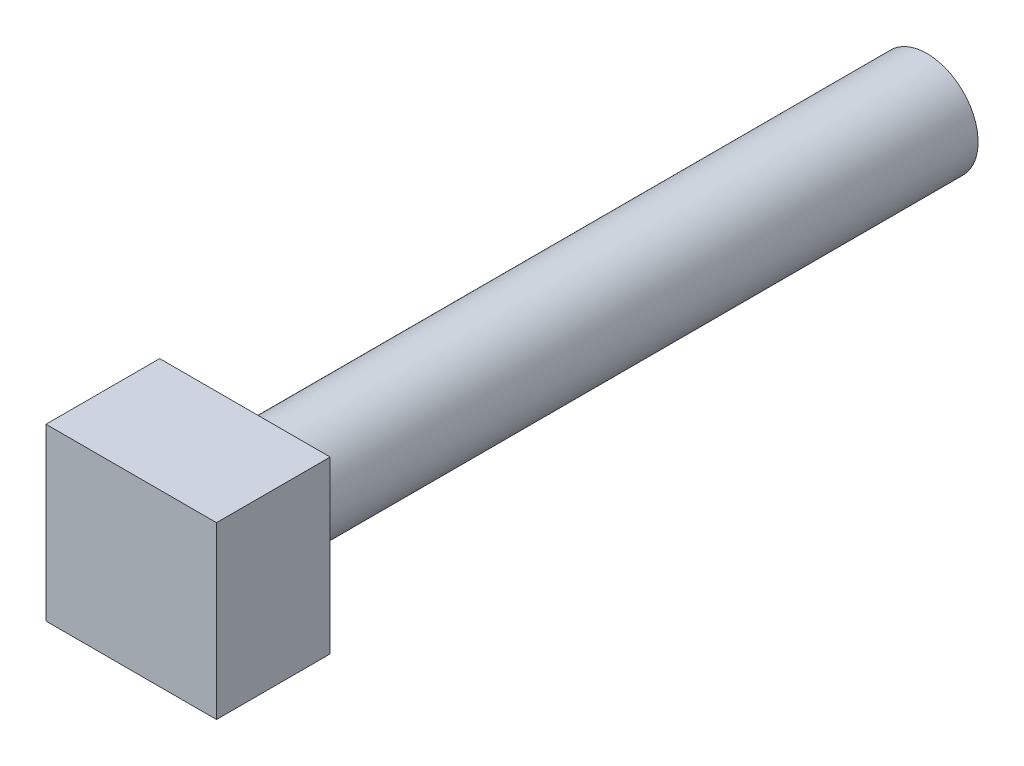
ISO-10303-21;
HEADER;
FILE_DESCRIPTION(('STEP AP214'),'2;1');
FILE_NAME('part.step','',(''),(''),'','','');
FILE_SCHEMA(('AUTOMOTIVE_DESIGN { 1 0 10303 214 1 1 1 1 }'));
ENDSEC;
DATA;
#1=APPLICATION_CONTEXT('core data for automotive mechanical design processes');
#2=APPLICATION_PROTOCOL_DEFINITION('international standard','automotive_design',2000,#1);
#3=PRODUCT_CONTEXT('',#1,'mechanical');
#4=PRODUCT('Part','Part','',(#3));
#5=PRODUCT_RELATED_PRODUCT_CATEGORY('part','',(#4));
#6=PRODUCT_DEFINITION_FORMATION('','',#4);
#7=PRODUCT_DEFINITION_CONTEXT('part definition',#1,'design');
#8=PRODUCT_DEFINITION('design','',#6,#7);
#9=PRODUCT_DEFINITION_SHAPE('','',#8);
#10=(LENGTH_UNIT() NAMED_UNIT(*) SI_UNIT(.MILLI.,.METRE.));
#11=(NAMED_UNIT(*) PLANE_ANGLE_UNIT() SI_UNIT($,.RADIAN.));
#12=(NAMED_UNIT(*) SI_UNIT($,.STERADIAN.) SOLID_ANGLE_UNIT());
#13=UNCERTAINTY_MEASURE_WITH_UNIT(LENGTH_MEASURE(1.E-05),#10,'distance_accuracy_value','');
#14=(GEOMETRIC_REPRESENTATION_CONTEXT(3) GLOBAL_UNCERTAINTY_ASSIGNED_CONTEXT((#13)) GLOBAL_UNIT_ASSIGNED_CONTEXT((#10,
#11,#12)) REPRESENTATION_CONTEXT('',''));
#15=CARTESIAN_POINT('',(0.,0.,0.));
#16=DIRECTION('',(0.,0.,1.));
#17=DIRECTION('',(1.,0.,0.));
#18=AXIS2_PLACEMENT_3D('',#15,#16,#17);
#19=CARTESIAN_POINT('',(4.7625,-4.7625,6.35));
#20=DIRECTION('',(-1.,0.,0.));
#21=DIRECTION('',(0.,0.,1.));
#22=AXIS2_PLACEMENT_3D('',#19,#20,#21);
#23=PLANE('',#22);
#24=DIRECTION('',(0.,1.,0.));
#25=VECTOR('',#24,1.);
#26=CARTESIAN_POINT('',(4.7625,-4.7625,0.));
#27=LINE('',#26,#25);
#28=CARTESIAN_POINT('',(4.7625,-4.7625,0.));
#29=VERTEX_POINT('',#28);
#30=CARTESIAN_POINT('',(4.7625,4.7625,0.));
#31=VERTEX_POINT('',#30);
#32=EDGE_CURVE('E110',#29,#31,#27,.T.);
#33=ORIENTED_EDGE('',*,*,#32,.T.);
#34=DIRECTION('',(0.,0.,-1.));
#35=VECTOR('',#34,1.);
#36=CARTESIAN_POINT('',(4.7625,4.7625,6.35));
#37=LINE('',#36,#35);
#38=CARTESIAN_POINT('',(4.7625,4.7625,6.35));
#39=VERTEX_POINT('',#38);
#40=EDGE_CURVE('E42',#39,#31,#37,.T.);
#41=ORIENTED_EDGE('',*,*,#40,.F.);
#42=DIRECTION('',(0.,1.,0.));
#43=VECTOR('',#42,1.);
#44=CARTESIAN_POINT('',(4.7625,-4.7625,6.35));
#45=LINE('',#44,#43);
#46=CARTESIAN_POINT('',(4.7625,-4.7625,6.35));
#47=VERTEX_POINT('',#46);
#48=EDGE_CURVE('E93',#47,#39,#45,.T.);
#49=ORIENTED_EDGE('',*,*,#48,.F.);
#50=DIRECTION('',(0.,0.,-1.));
#51=VECTOR('',#50,1.);
#52=CARTESIAN_POINT('',(4.7625,-4.7625,6.35));
#53=LINE('',#52,#51);
#54=EDGE_CURVE('E106',#47,#29,#53,.T.);
#55=ORIENTED_EDGE('',*,*,#54,.T.);
#56=EDGE_LOOP('',(#33,#41,#49,#55));
#57=FACE_BOUND('',#56,.T.);
#58=ADVANCED_FACE('F39',(#57),#23,.F.);
#59=CARTESIAN_POINT('',(-4.7625,4.7625,6.35));
#60=DIRECTION('',(0.,-1.,0.));
#61=DIRECTION('',(0.,0.,-1.));
#62=AXIS2_PLACEMENT_3D('',#59,#60,#61);
#63=PLANE('',#62);
#64=DIRECTION('',(-1.,0.,0.));
#65=VECTOR('',#64,1.);
#66=CARTESIAN_POINT('',(-4.7625,4.7625,0.));
#67=LINE('',#66,#65);
#68=CARTESIAN_POINT('',(-4.7625,4.7625,0.));
#69=VERTEX_POINT('',#68);
#70=EDGE_CURVE('E99',#31,#69,#67,.T.);
#71=ORIENTED_EDGE('',*,*,#70,.T.);
#72=DIRECTION('',(0.,0.,-1.));
#73=VECTOR('',#72,1.);
#74=CARTESIAN_POINT('',(-4.7625,4.7625,6.35));
#75=LINE('',#74,#73);
#76=CARTESIAN_POINT('',(-4.7625,4.7625,6.35));
#77=VERTEX_POINT('',#76);
#78=EDGE_CURVE('E97',#77,#69,#75,.T.);
#79=ORIENTED_EDGE('',*,*,#78,.F.);
#80=DIRECTION('',(-1.,0.,0.));
#81=VECTOR('',#80,1.);
#82=CARTESIAN_POINT('',(-4.7625,4.7625,6.35));
#83=LINE('',#82,#81);
#84=EDGE_CURVE('E88',#39,#77,#83,.T.);
#85=ORIENTED_EDGE('',*,*,#84,.F.);
#86=ORIENTED_EDGE('',*,*,#40,.T.);
#87=EDGE_LOOP('',(#71,#79,#85,#86));
#88=FACE_BOUND('',#87,.T.);
#89=ADVANCED_FACE('F98',(#88),#63,.F.);
#90=CARTESIAN_POINT('',(-4.7625,-4.7625,6.35));
#91=DIRECTION('',(1.,0.,0.));
#92=DIRECTION('',(0.,0.,-1.));
#93=AXIS2_PLACEMENT_3D('',#90,#91,#92);
#94=PLANE('',#93);
#95=DIRECTION('',(0.,-1.,0.));
#96=VECTOR('',#95,1.);
#97=CARTESIAN_POINT('',(-4.7625,-4.7625,0.));
#98=LINE('',#97,#96);
#99=CARTESIAN_POINT('',(-4.7625,-4.7625,0.));
#100=VERTEX_POINT('',#99);
#101=EDGE_CURVE('E74',#69,#100,#98,.T.);
#102=ORIENTED_EDGE('',*,*,#101,.T.);
#103=DIRECTION('',(0.,0.,-1.));
#104=VECTOR('',#103,1.);
#105=CARTESIAN_POINT('',(-4.7625,-4.7625,6.35));
#106=LINE('',#105,#104);
#107=CARTESIAN_POINT('',(-4.7625,-4.7625,6.35));
#108=VERTEX_POINT('',#107);
#109=EDGE_CURVE('E101',#108,#100,#106,.T.);
#110=ORIENTED_EDGE('',*,*,#109,.F.);
#111=DIRECTION('',(0.,-1.,0.));
#112=VECTOR('',#111,1.);
#113=CARTESIAN_POINT('',(-4.7625,-4.7625,6.35));
#114=LINE('',#113,#112);
#115=EDGE_CURVE('E91',#77,#108,#114,.T.);
#116=ORIENTED_EDGE('',*,*,#115,.F.);
#117=ORIENTED_EDGE('',*,*,#78,.T.);
#118=EDGE_LOOP('',(#102,#110,#116,#117));
#119=FACE_BOUND('',#118,.T.);
#120=ADVANCED_FACE('F102',(#119),#94,.F.);
#121=CARTESIAN_POINT('',(-4.7625,-4.7625,6.35));
#122=DIRECTION('',(0.,1.,0.));
#123=DIRECTION('',(0.,0.,1.));
#124=AXIS2_PLACEMENT_3D('',#121,#122,#123);
#125=PLANE('',#124);
#126=DIRECTION('',(1.,0.,0.));
#127=VECTOR('',#126,1.);
#128=CARTESIAN_POINT('',(-4.7625,-4.7625,0.));
#129=LINE('',#128,#127);
#130=EDGE_CURVE('E80',#100,#29,#129,.T.);
#131=ORIENTED_EDGE('',*,*,#130,.T.);
#132=ORIENTED_EDGE('',*,*,#54,.F.);
#133=DIRECTION('',(1.,0.,0.));
#134=VECTOR('',#133,1.);
#135=CARTESIAN_POINT('',(-4.7625,-4.7625,6.35));
#136=LINE('',#135,#134);
#137=EDGE_CURVE('E57',#108,#47,#136,.T.);
#138=ORIENTED_EDGE('',*,*,#137,.F.);
#139=ORIENTED_EDGE('',*,*,#109,.T.);
#140=EDGE_LOOP('',(#131,#132,#138,#139));
#141=FACE_BOUND('',#140,.T.);
#142=ADVANCED_FACE('F124',(#141),#125,.F.);
#143=CARTESIAN_POINT('',(0.,0.,6.35));
#144=DIRECTION('',(0.,0.,-1.));
#145=DIRECTION('',(-1.,0.,0.));
#146=AXIS2_PLACEMENT_3D('',#143,#144,#145);
#147=PLANE('',#146);
#148=ORIENTED_EDGE('',*,*,#48,.T.);
#149=ORIENTED_EDGE('',*,*,#84,.T.);
#150=ORIENTED_EDGE('',*,*,#115,.T.);
#151=ORIENTED_EDGE('',*,*,#137,.T.);
#152=EDGE_LOOP('',(#148,#149,#150,#151));
#153=FACE_BOUND('',#152,.T.);
#154=ADVANCED_FACE('F89',(#153),#147,.F.);
#155=CARTESIAN_POINT('',(0.,0.,0.));
#156=DIRECTION('',(0.,0.,-1.));
#157=DIRECTION('',(-1.,0.,0.));
#158=AXIS2_PLACEMENT_3D('',#155,#156,#157);
#159=PLANE('',#158);
#160=CARTESIAN_POINT('',(0.,0.,0.));
#161=DIRECTION('',(0.,0.,-1.));
#162=DIRECTION('',(-1.,0.,0.));
#163=AXIS2_PLACEMENT_3D('',#160,#161,#162);
#164=CIRCLE('',#163,2.8575);
#165=CARTESIAN_POINT('',(-2.8575,0.,0.));
#166=VERTEX_POINT('',#165);
#167=EDGE_CURVE('E11',#166,#166,#164,.T.);
#168=ORIENTED_EDGE('',*,*,#167,.F.);
#169=EDGE_LOOP('',(#168));
#170=FACE_BOUND('',#169,.T.);
#171=ORIENTED_EDGE('',*,*,#32,.F.);
#172=ORIENTED_EDGE('',*,*,#130,.F.);
#173=ORIENTED_EDGE('',*,*,#101,.F.);
#174=ORIENTED_EDGE('',*,*,#70,.F.);
#175=EDGE_LOOP('',(#171,#172,#173,#174));
#176=FACE_BOUND('',#175,.T.);
#177=ADVANCED_FACE('F127',(#170,#176),#159,.T.);
#178=CARTESIAN_POINT('',(0.,0.,-38.1));
#179=DIRECTION('',(0.,0.,1.));
#180=DIRECTION('',(1.,0.,0.));
#181=AXIS2_PLACEMENT_3D('',#178,#179,#180);
#182=CYLINDRICAL_SURFACE('',#181,2.8575);
#183=CARTESIAN_POINT('',(0.,0.,-38.1));
#184=DIRECTION('',(0.,0.,-1.));
#185=DIRECTION('',(-1.,0.,0.));
#186=AXIS2_PLACEMENT_3D('',#183,#184,#185);
#187=CIRCLE('',#186,2.8575);
#188=CARTESIAN_POINT('',(-2.8575,0.,-38.1));
#189=VERTEX_POINT('',#188);
#190=EDGE_CURVE('E114',#189,#189,#187,.T.);
#191=ORIENTED_EDGE('',*,*,#190,.F.);
#192=EDGE_LOOP('',(#191));
#193=FACE_BOUND('',#192,.T.);
#194=ORIENTED_EDGE('',*,*,#167,.T.);
#195=EDGE_LOOP('',(#194));
#196=FACE_BOUND('',#195,.T.);
#197=ADVANCED_FACE('F137',(#193,#196),#182,.T.);
#198=CARTESIAN_POINT('',(0.,0.,-38.1));
#199=DIRECTION('',(0.,0.,-1.));
#200=DIRECTION('',(-1.,0.,0.));
#201=AXIS2_PLACEMENT_3D('',#198,#199,#200);
#202=PLANE('',#201);
#203=ORIENTED_EDGE('',*,*,#190,.T.);
#204=EDGE_LOOP('',(#203));
#205=FACE_BOUND('',#204,.T.);
#206=ADVANCED_FACE('F135',(#205),#202,.T.);
#207=CLOSED_SHELL('',(#58,#89,#120,#142,#154,#177,#197,#206));
#208=MANIFOLD_SOLID_BREP('B2',#207);
#209=ADVANCED_BREP_SHAPE_REPRESENTATION('',(#18,#208),#14);
#210=SHAPE_DEFINITION_REPRESENTATION(#9,#209);
ENDSEC;
END-ISO-10303-21;
